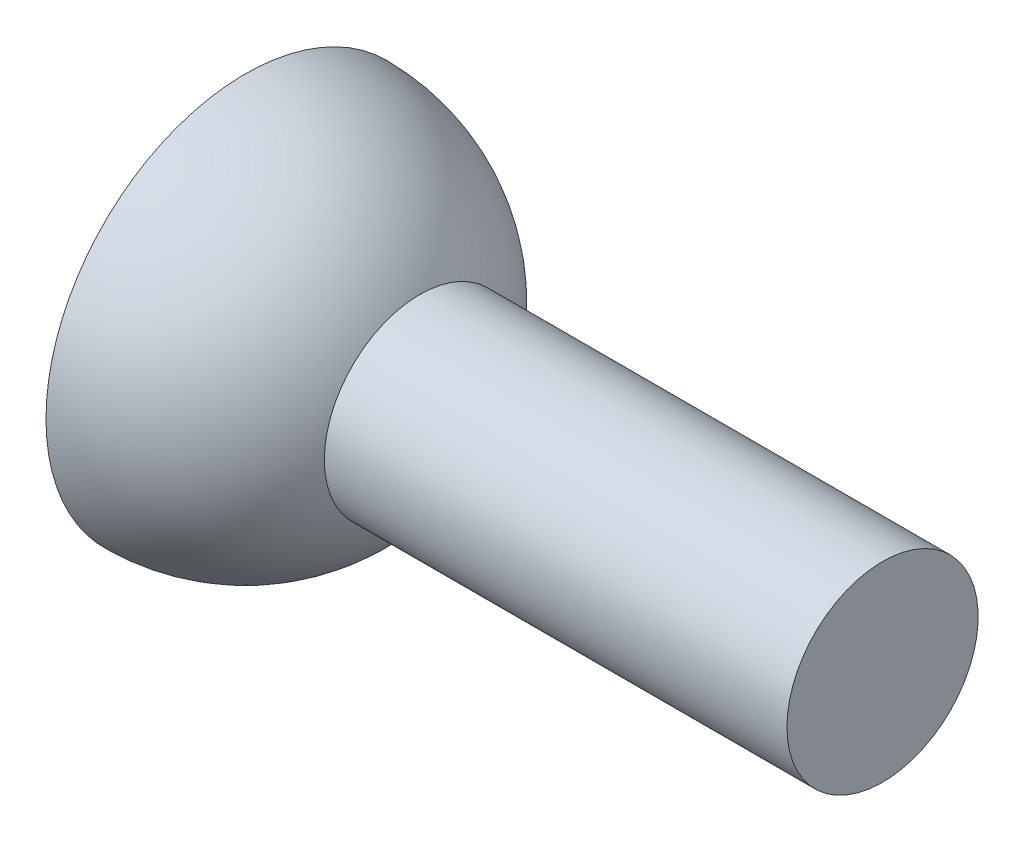
ISO-10303-21;
HEADER;
FILE_DESCRIPTION(('STEP AP214'),'2;1');
FILE_NAME('part.step','',(''),(''),'','','');
FILE_SCHEMA(('AUTOMOTIVE_DESIGN { 1 0 10303 214 1 1 1 1 }'));
ENDSEC;
DATA;
#1=APPLICATION_CONTEXT('core data for automotive mechanical design processes');
#2=APPLICATION_PROTOCOL_DEFINITION('international standard','automotive_design',2000,#1);
#3=PRODUCT_CONTEXT('',#1,'mechanical');
#4=PRODUCT('Part','Part','',(#3));
#5=PRODUCT_RELATED_PRODUCT_CATEGORY('part','',(#4));
#6=PRODUCT_DEFINITION_FORMATION('','',#4);
#7=PRODUCT_DEFINITION_CONTEXT('part definition',#1,'design');
#8=PRODUCT_DEFINITION('design','',#6,#7);
#9=PRODUCT_DEFINITION_SHAPE('','',#8);
#10=(LENGTH_UNIT() NAMED_UNIT(*) SI_UNIT(.MILLI.,.METRE.));
#11=(NAMED_UNIT(*) PLANE_ANGLE_UNIT() SI_UNIT($,.RADIAN.));
#12=(NAMED_UNIT(*) SI_UNIT($,.STERADIAN.) SOLID_ANGLE_UNIT());
#13=UNCERTAINTY_MEASURE_WITH_UNIT(LENGTH_MEASURE(1.E-05),#10,'distance_accuracy_value','');
#14=(GEOMETRIC_REPRESENTATION_CONTEXT(3) GLOBAL_UNCERTAINTY_ASSIGNED_CONTEXT((#13)) GLOBAL_UNIT_ASSIGNED_CONTEXT((#10,
#11,#12)) REPRESENTATION_CONTEXT('',''));
#15=CARTESIAN_POINT('',(0.,0.,0.));
#16=DIRECTION('',(0.,0.,1.));
#17=DIRECTION('',(1.,0.,0.));
#18=AXIS2_PLACEMENT_3D('',#15,#16,#17);
#19=CARTESIAN_POINT('',(0.,0.,0.));
#20=DIRECTION('',(-1.,0.,0.));
#21=DIRECTION('',(0.,0.,1.));
#22=AXIS2_PLACEMENT_3D('',#19,#20,#21);
#23=SPHERICAL_SURFACE('',#22,25.);
#24=CARTESIAN_POINT('',(0.,0.,0.));
#25=DIRECTION('',(-1.,0.,0.));
#26=DIRECTION('',(0.,0.,1.));
#27=AXIS2_PLACEMENT_3D('',#24,#25,#26);
#28=CIRCLE('',#27,25.);
#29=CARTESIAN_POINT('',(0.,0.,25.));
#30=VERTEX_POINT('',#29);
#31=EDGE_CURVE('E52',#30,#30,#28,.T.);
#32=ORIENTED_EDGE('',*,*,#31,.F.);
#33=EDGE_LOOP('',(#32));
#34=FACE_BOUND('',#33,.T.);
#35=CARTESIAN_POINT('',(21.9317121994613,0.,0.));
#36=DIRECTION('',(-1.,0.,0.));
#37=DIRECTION('',(0.,0.,1.));
#38=AXIS2_PLACEMENT_3D('',#35,#36,#37);
#39=CIRCLE('',#38,12.);
#40=CARTESIAN_POINT('',(21.9317121994613,0.,12.));
#41=VERTEX_POINT('',#40);
#42=EDGE_CURVE('E11',#41,#41,#39,.F.);
#43=ORIENTED_EDGE('',*,*,#42,.F.);
#44=EDGE_LOOP('',(#43));
#45=FACE_BOUND('',#44,.T.);
#46=ADVANCED_FACE('F45',(#34,#45),#23,.T.);
#47=CARTESIAN_POINT('',(0.,0.,-25.));
#48=DIRECTION('',(1.,0.,0.));
#49=DIRECTION('',(0.,0.,-1.));
#50=AXIS2_PLACEMENT_3D('',#47,#48,#49);
#51=PLANE('',#50);
#52=CARTESIAN_POINT('',(0.,0.,0.));
#53=DIRECTION('',(1.,0.,0.));
#54=DIRECTION('',(0.,0.,-1.));
#55=AXIS2_PLACEMENT_3D('',#52,#53,#54);
#56=CIRCLE('',#55,20.);
#57=CARTESIAN_POINT('',(0.,0.,-20.));
#58=VERTEX_POINT('',#57);
#59=EDGE_CURVE('E63',#58,#58,#56,.F.);
#60=ORIENTED_EDGE('',*,*,#59,.F.);
#61=EDGE_LOOP('',(#60));
#62=FACE_BOUND('',#61,.T.);
#63=ORIENTED_EDGE('',*,*,#31,.T.);
#64=EDGE_LOOP('',(#63));
#65=FACE_BOUND('',#64,.T.);
#66=ADVANCED_FACE('F59',(#62,#65),#51,.F.);
#67=CARTESIAN_POINT('',(0.,0.,0.));
#68=DIRECTION('',(-1.,0.,0.));
#69=DIRECTION('',(0.,0.,1.));
#70=AXIS2_PLACEMENT_3D('',#67,#68,#69);
#71=SPHERICAL_SURFACE('',#70,20.);
#72=CARTESIAN_POINT('',(20.,0.,0.));
#73=VERTEX_POINT('',#72);
#74=VERTEX_LOOP('',#73);
#75=FACE_BOUND('',#74,.T.);
#76=ORIENTED_EDGE('',*,*,#59,.T.);
#77=EDGE_LOOP('',(#76));
#78=FACE_BOUND('',#77,.T.);
#79=ADVANCED_FACE('F55',(#75,#78),#71,.F.);
#80=CARTESIAN_POINT('',(20.,0.,0.));
#81=DIRECTION('',(-1.,0.,0.));
#82=DIRECTION('',(0.,0.,1.));
#83=AXIS2_PLACEMENT_3D('',#80,#81,#82);
#84=CYLINDRICAL_SURFACE('',#83,12.);
#85=CARTESIAN_POINT('',(80.,0.,0.));
#86=DIRECTION('',(-1.,0.,0.));
#87=DIRECTION('',(0.,0.,1.));
#88=AXIS2_PLACEMENT_3D('',#85,#86,#87);
#89=CIRCLE('',#88,12.);
#90=CARTESIAN_POINT('',(80.,0.,12.));
#91=VERTEX_POINT('',#90);
#92=EDGE_CURVE('E66',#91,#91,#89,.T.);
#93=ORIENTED_EDGE('',*,*,#92,.T.);
#94=EDGE_LOOP('',(#93));
#95=FACE_BOUND('',#94,.T.);
#96=ORIENTED_EDGE('',*,*,#42,.T.);
#97=EDGE_LOOP('',(#96));
#98=FACE_BOUND('',#97,.T.);
#99=ADVANCED_FACE('F58',(#95,#98),#84,.T.);
#100=CARTESIAN_POINT('',(80.,12.,0.));
#101=DIRECTION('',(-1.,0.,0.));
#102=DIRECTION('',(0.,0.,1.));
#103=AXIS2_PLACEMENT_3D('',#100,#101,#102);
#104=PLANE('',#103);
#105=ORIENTED_EDGE('',*,*,#92,.F.);
#106=EDGE_LOOP('',(#105));
#107=FACE_BOUND('',#106,.T.);
#108=ADVANCED_FACE('F77',(#107),#104,.F.);
#109=CLOSED_SHELL('',(#46,#66,#79,#99,#108));
#110=MANIFOLD_SOLID_BREP('B2',#109);
#111=ADVANCED_BREP_SHAPE_REPRESENTATION('',(#18,#110),#14);
#112=SHAPE_DEFINITION_REPRESENTATION(#9,#111);
ENDSEC;
END-ISO-10303-21;
